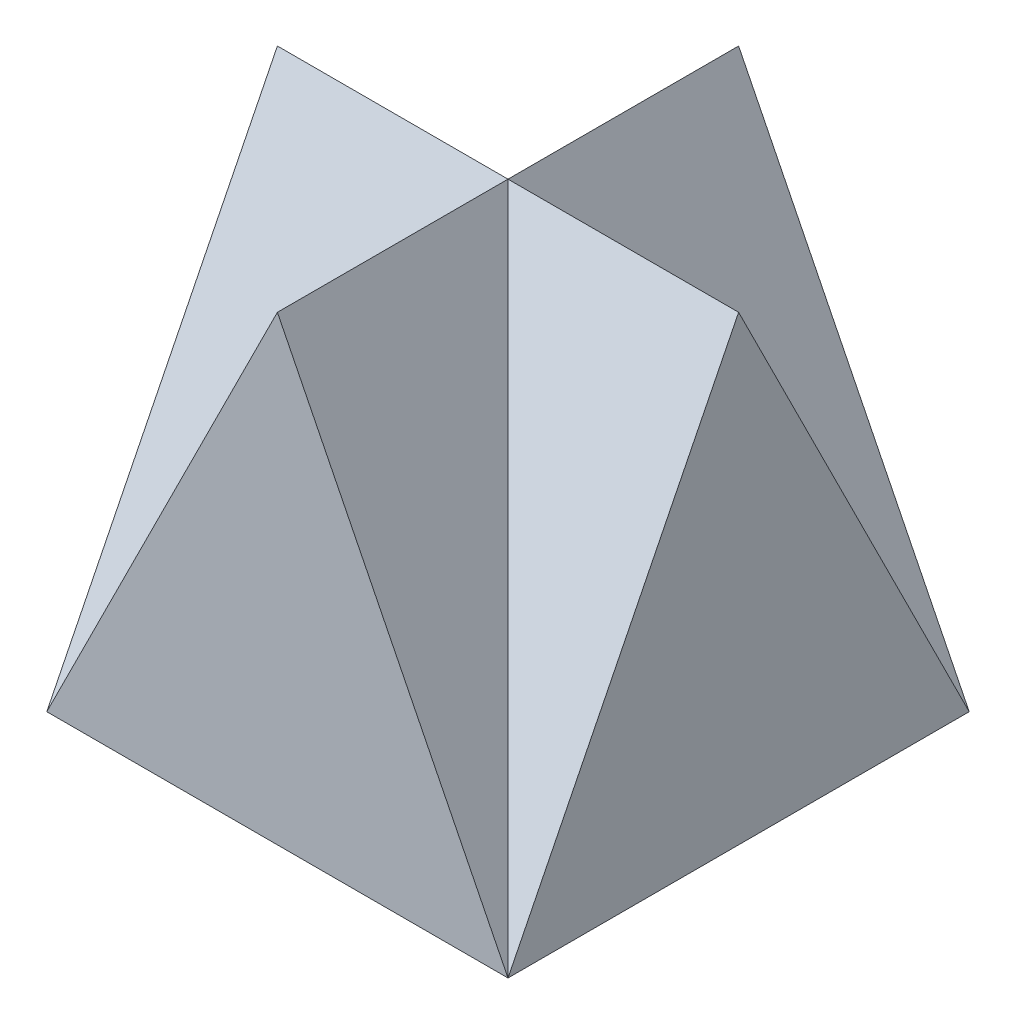
ISO-10303-21;
HEADER;
FILE_DESCRIPTION(('STEP AP214'),'2;1');
FILE_NAME('part.step','',(''),(''),'','','');
FILE_SCHEMA(('AUTOMOTIVE_DESIGN { 1 0 10303 214 1 1 1 1 }'));
ENDSEC;
DATA;
#1=APPLICATION_CONTEXT('core data for automotive mechanical design processes');
#2=APPLICATION_PROTOCOL_DEFINITION('international standard','automotive_design',2000,#1);
#3=PRODUCT_CONTEXT('',#1,'mechanical');
#4=PRODUCT('Part','Part','',(#3));
#5=PRODUCT_RELATED_PRODUCT_CATEGORY('part','',(#4));
#6=PRODUCT_DEFINITION_FORMATION('','',#4);
#7=PRODUCT_DEFINITION_CONTEXT('part definition',#1,'design');
#8=PRODUCT_DEFINITION('design','',#6,#7);
#9=PRODUCT_DEFINITION_SHAPE('','',#8);
#10=(LENGTH_UNIT() NAMED_UNIT(*) SI_UNIT(.MILLI.,.METRE.));
#11=(NAMED_UNIT(*) PLANE_ANGLE_UNIT() SI_UNIT($,.RADIAN.));
#12=(NAMED_UNIT(*) SI_UNIT($,.STERADIAN.) SOLID_ANGLE_UNIT());
#13=UNCERTAINTY_MEASURE_WITH_UNIT(LENGTH_MEASURE(1.E-05),#10,'distance_accuracy_value','');
#14=(GEOMETRIC_REPRESENTATION_CONTEXT(3) GLOBAL_UNCERTAINTY_ASSIGNED_CONTEXT((#13)) GLOBAL_UNIT_ASSIGNED_CONTEXT((#10,
#11,#12)) REPRESENTATION_CONTEXT('',''));
#15=CARTESIAN_POINT('',(0.,0.,0.));
#16=DIRECTION('',(0.,0.,1.));
#17=DIRECTION('',(1.,0.,0.));
#18=AXIS2_PLACEMENT_3D('',#15,#16,#17);
#19=CARTESIAN_POINT('',(1.99999999999999,4.,2.));
#20=DIRECTION('',(-1.,0.,0.));
#21=DIRECTION('',(0.,0.,1.));
#22=AXIS2_PLACEMENT_3D('',#19,#20,#21);
#23=PLANE('',#22);
#24=DIRECTION('',(0.,-0.894427190999916,-0.447213595499958));
#25=VECTOR('',#24,1.);
#26=CARTESIAN_POINT('',(1.99999999999999,4.8,0.399999999999996));
#27=LINE('',#26,#25);
#28=CARTESIAN_POINT('',(1.99999999999999,4.,0.));
#29=VERTEX_POINT('',#28);
#30=CARTESIAN_POINT('',(1.99999999999999,0.,-2.00000000000001));
#31=VERTEX_POINT('',#30);
#32=EDGE_CURVE('E85',#29,#31,#27,.T.);
#33=ORIENTED_EDGE('',*,*,#32,.F.);
#34=DIRECTION('',(0.,-0.894427190999916,0.447213595499958));
#35=VECTOR('',#34,1.);
#36=CARTESIAN_POINT('',(1.99999999999999,3.2,0.399999999999997));
#37=LINE('',#36,#35);
#38=CARTESIAN_POINT('',(1.99999999999999,0.,2.));
#39=VERTEX_POINT('',#38);
#40=EDGE_CURVE('E122',#29,#39,#37,.T.);
#41=ORIENTED_EDGE('',*,*,#40,.T.);
#42=DIRECTION('',(0.,0.,-1.));
#43=VECTOR('',#42,1.);
#44=CARTESIAN_POINT('',(1.99999999999999,0.,2.));
#45=LINE('',#44,#43);
#46=EDGE_CURVE('E119',#39,#31,#45,.T.);
#47=ORIENTED_EDGE('',*,*,#46,.T.);
#48=EDGE_LOOP('',(#33,#41,#47));
#49=FACE_BOUND('',#48,.T.);
#50=ADVANCED_FACE('F38',(#49),#23,.F.);
#51=CARTESIAN_POINT('',(-2.00000000000001,4.,-2.00000000000001));
#52=DIRECTION('',(0.,0.,1.));
#53=DIRECTION('',(1.,0.,0.));
#54=AXIS2_PLACEMENT_3D('',#51,#52,#53);
#55=PLANE('',#54);
#56=DIRECTION('',(0.447213595499958,0.894427190999916,0.));
#57=VECTOR('',#56,1.);
#58=CARTESIAN_POINT('',(-2.00000000000001,0.,-2.00000000000001));
#59=LINE('',#58,#57);
#60=CARTESIAN_POINT('',(-2.00000000000001,0.,-2.00000000000001));
#61=VERTEX_POINT('',#60);
#62=CARTESIAN_POINT('',(0.,4.,-2.00000000000001));
#63=VERTEX_POINT('',#62);
#64=EDGE_CURVE('E113',#61,#63,#59,.T.);
#65=ORIENTED_EDGE('',*,*,#64,.T.);
#66=DIRECTION('',(0.447213595499958,-0.894427190999916,0.));
#67=VECTOR('',#66,1.);
#68=CARTESIAN_POINT('',(0.,4.,-2.00000000000001));
#69=LINE('',#68,#67);
#70=EDGE_CURVE('E97',#63,#31,#69,.T.);
#71=ORIENTED_EDGE('',*,*,#70,.T.);
#72=DIRECTION('',(-1.,0.,0.));
#73=VECTOR('',#72,1.);
#74=CARTESIAN_POINT('',(-2.00000000000001,0.,-2.00000000000001));
#75=LINE('',#74,#73);
#76=EDGE_CURVE('E111',#31,#61,#75,.T.);
#77=ORIENTED_EDGE('',*,*,#76,.T.);
#78=EDGE_LOOP('',(#65,#71,#77));
#79=FACE_BOUND('',#78,.T.);
#80=ADVANCED_FACE('F110',(#79),#55,.F.);
#81=CARTESIAN_POINT('',(-2.00000000000001,4.,2.));
#82=DIRECTION('',(1.,0.,0.));
#83=DIRECTION('',(0.,0.,-1.));
#84=AXIS2_PLACEMENT_3D('',#81,#82,#83);
#85=PLANE('',#84);
#86=DIRECTION('',(0.,-0.894427190999916,0.447213595499959));
#87=VECTOR('',#86,1.);
#88=CARTESIAN_POINT('',(-2.00000000000001,3.2,0.399999999999997));
#89=LINE('',#88,#87);
#90=CARTESIAN_POINT('',(-2.00000000000001,4.,0.));
#91=VERTEX_POINT('',#90);
#92=CARTESIAN_POINT('',(-2.00000000000001,0.,2.));
#93=VERTEX_POINT('',#92);
#94=EDGE_CURVE('E61',#91,#93,#89,.T.);
#95=ORIENTED_EDGE('',*,*,#94,.F.);
#96=DIRECTION('',(0.,-0.894427190999916,-0.447213595499958));
#97=VECTOR('',#96,1.);
#98=CARTESIAN_POINT('',(-2.00000000000001,4.,0.));
#99=LINE('',#98,#97);
#100=EDGE_CURVE('E54',#91,#61,#99,.T.);
#101=ORIENTED_EDGE('',*,*,#100,.T.);
#102=DIRECTION('',(0.,0.,1.));
#103=VECTOR('',#102,1.);
#104=CARTESIAN_POINT('',(-2.00000000000001,0.,2.));
#105=LINE('',#104,#103);
#106=EDGE_CURVE('E46',#61,#93,#105,.T.);
#107=ORIENTED_EDGE('',*,*,#106,.T.);
#108=EDGE_LOOP('',(#95,#101,#107));
#109=FACE_BOUND('',#108,.T.);
#110=ADVANCED_FACE('F195',(#109),#85,.F.);
#111=CARTESIAN_POINT('',(-2.00000000000001,4.,2.));
#112=DIRECTION('',(0.,0.,-1.));
#113=DIRECTION('',(-1.,0.,0.));
#114=AXIS2_PLACEMENT_3D('',#111,#112,#113);
#115=PLANE('',#114);
#116=DIRECTION('',(1.,0.,0.));
#117=VECTOR('',#116,1.);
#118=CARTESIAN_POINT('',(-2.00000000000001,0.,2.));
#119=LINE('',#118,#117);
#120=EDGE_CURVE('E12',#93,#39,#119,.T.);
#121=ORIENTED_EDGE('',*,*,#120,.T.);
#122=DIRECTION('',(0.447213595499958,-0.894427190999916,0.));
#123=VECTOR('',#122,1.);
#124=CARTESIAN_POINT('',(0.,4.,2.));
#125=LINE('',#124,#123);
#126=CARTESIAN_POINT('',(0.,4.,2.));
#127=VERTEX_POINT('',#126);
#128=EDGE_CURVE('E96',#127,#39,#125,.T.);
#129=ORIENTED_EDGE('',*,*,#128,.F.);
#130=DIRECTION('',(-0.447213595499958,-0.894427190999916,0.));
#131=VECTOR('',#130,1.);
#132=CARTESIAN_POINT('',(0.,4.,2.));
#133=LINE('',#132,#131);
#134=EDGE_CURVE('E123',#127,#93,#133,.T.);
#135=ORIENTED_EDGE('',*,*,#134,.T.);
#136=EDGE_LOOP('',(#121,#129,#135));
#137=FACE_BOUND('',#136,.T.);
#138=ADVANCED_FACE('F190',(#137),#115,.F.);
#139=CARTESIAN_POINT('',(0.,0.,0.));
#140=DIRECTION('',(0.,-1.,0.));
#141=DIRECTION('',(0.,0.,-1.));
#142=AXIS2_PLACEMENT_3D('',#139,#140,#141);
#143=PLANE('',#142);
#144=ORIENTED_EDGE('',*,*,#46,.F.);
#145=ORIENTED_EDGE('',*,*,#120,.F.);
#146=ORIENTED_EDGE('',*,*,#106,.F.);
#147=ORIENTED_EDGE('',*,*,#76,.F.);
#148=EDGE_LOOP('',(#144,#145,#146,#147));
#149=FACE_BOUND('',#148,.T.);
#150=ADVANCED_FACE('F117',(#149),#143,.T.);
#151=CARTESIAN_POINT('',(-2.00000000000001,0.,2.));
#152=DIRECTION('',(0.,0.447213595499959,0.894427190999916));
#153=DIRECTION('',(0.,-0.894427190999916,0.447213595499959));
#154=AXIS2_PLACEMENT_3D('',#151,#152,#153);
#155=PLANE('',#154);
#156=ORIENTED_EDGE('',*,*,#94,.T.);
#157=DIRECTION('',(0.408248290463863,0.816496580927726,-0.408248290463864));
#158=VECTOR('',#157,1.);
#159=CARTESIAN_POINT('',(-2.00000000000001,0.,2.));
#160=LINE('',#159,#158);
#161=CARTESIAN_POINT('',(0.,4.,0.));
#162=VERTEX_POINT('',#161);
#163=EDGE_CURVE('E143',#93,#162,#160,.T.);
#164=ORIENTED_EDGE('',*,*,#163,.T.);
#165=DIRECTION('',(-1.,0.,0.));
#166=VECTOR('',#165,1.);
#167=CARTESIAN_POINT('',(0.,4.,0.));
#168=LINE('',#167,#166);
#169=EDGE_CURVE('E137',#162,#91,#168,.T.);
#170=ORIENTED_EDGE('',*,*,#169,.T.);
#171=EDGE_LOOP('',(#156,#164,#170));
#172=FACE_BOUND('',#171,.T.);
#173=ADVANCED_FACE('F193',(#172),#155,.T.);
#174=CARTESIAN_POINT('',(-1.6,0.799999999999996,0.));
#175=DIRECTION('',(-0.894427190999917,0.447213595499957,0.));
#176=DIRECTION('',(-0.447213595499957,-0.894427190999917,0.));
#177=AXIS2_PLACEMENT_3D('',#174,#175,#176);
#178=PLANE('',#177);
#179=ORIENTED_EDGE('',*,*,#134,.F.);
#180=DIRECTION('',(0.,0.,1.));
#181=VECTOR('',#180,1.);
#182=CARTESIAN_POINT('',(0.,4.,0.));
#183=LINE('',#182,#181);
#184=EDGE_CURVE('E139',#162,#127,#183,.T.);
#185=ORIENTED_EDGE('',*,*,#184,.F.);
#186=ORIENTED_EDGE('',*,*,#163,.F.);
#187=EDGE_LOOP('',(#179,#185,#186));
#188=FACE_BOUND('',#187,.T.);
#189=ADVANCED_FACE('F192',(#188),#178,.T.);
#190=CARTESIAN_POINT('',(0.,0.800000000000002,-1.60000000000001));
#191=DIRECTION('',(0.,-0.447213595499958,0.894427190999916));
#192=DIRECTION('',(0.,-0.894427190999916,-0.447213595499958));
#193=AXIS2_PLACEMENT_3D('',#190,#191,#192);
#194=PLANE('',#193);
#195=ORIENTED_EDGE('',*,*,#100,.F.);
#196=ORIENTED_EDGE('',*,*,#169,.F.);
#197=DIRECTION('',(0.408248290463863,0.816496580927726,0.408248290463863));
#198=VECTOR('',#197,1.);
#199=CARTESIAN_POINT('',(-2.00000000000001,0.,-2.00000000000001));
#200=LINE('',#199,#198);
#201=EDGE_CURVE('E140',#61,#162,#200,.T.);
#202=ORIENTED_EDGE('',*,*,#201,.F.);
#203=EDGE_LOOP('',(#195,#196,#202));
#204=FACE_BOUND('',#203,.T.);
#205=ADVANCED_FACE('F244',(#204),#194,.F.);
#206=CARTESIAN_POINT('',(-1.6,0.8,0.));
#207=DIRECTION('',(-0.894427190999916,0.447213595499957,0.));
#208=DIRECTION('',(-0.447213595499957,-0.894427190999916,0.));
#209=AXIS2_PLACEMENT_3D('',#206,#207,#208);
#210=PLANE('',#209);
#211=ORIENTED_EDGE('',*,*,#64,.F.);
#212=ORIENTED_EDGE('',*,*,#201,.T.);
#213=DIRECTION('',(0.,0.,1.));
#214=VECTOR('',#213,1.);
#215=CARTESIAN_POINT('',(0.,4.,0.));
#216=LINE('',#215,#214);
#217=EDGE_CURVE('E103',#63,#162,#216,.T.);
#218=ORIENTED_EDGE('',*,*,#217,.F.);
#219=EDGE_LOOP('',(#211,#212,#218));
#220=FACE_BOUND('',#219,.T.);
#221=ADVANCED_FACE('F252',(#220),#210,.T.);
#222=CARTESIAN_POINT('',(1.99999999999999,0.,2.));
#223=DIRECTION('',(0.,-0.447213595499958,-0.894427190999916));
#224=DIRECTION('',(0.,0.894427190999916,-0.447213595499958));
#225=AXIS2_PLACEMENT_3D('',#222,#223,#224);
#226=PLANE('',#225);
#227=DIRECTION('',(1.,0.,0.));
#228=VECTOR('',#227,1.);
#229=CARTESIAN_POINT('',(0.,4.,0.));
#230=LINE('',#229,#228);
#231=EDGE_CURVE('E91',#162,#29,#230,.T.);
#232=ORIENTED_EDGE('',*,*,#231,.F.);
#233=DIRECTION('',(-0.408248290463863,0.816496580927726,-0.408248290463864));
#234=VECTOR('',#233,1.);
#235=CARTESIAN_POINT('',(1.99999999999999,0.,2.));
#236=LINE('',#235,#234);
#237=EDGE_CURVE('E168',#39,#162,#236,.T.);
#238=ORIENTED_EDGE('',*,*,#237,.F.);
#239=ORIENTED_EDGE('',*,*,#40,.F.);
#240=EDGE_LOOP('',(#232,#238,#239));
#241=FACE_BOUND('',#240,.T.);
#242=ADVANCED_FACE('F260',(#241),#226,.F.);
#243=CARTESIAN_POINT('',(1.6,0.799999999999998,0.));
#244=DIRECTION('',(-0.894427190999916,-0.447213595499958,0.));
#245=DIRECTION('',(0.447213595499958,-0.894427190999916,0.));
#246=AXIS2_PLACEMENT_3D('',#243,#244,#245);
#247=PLANE('',#246);
#248=ORIENTED_EDGE('',*,*,#237,.T.);
#249=ORIENTED_EDGE('',*,*,#184,.T.);
#250=ORIENTED_EDGE('',*,*,#128,.T.);
#251=EDGE_LOOP('',(#248,#249,#250));
#252=FACE_BOUND('',#251,.T.);
#253=ADVANCED_FACE('F186',(#252),#247,.F.);
#254=CARTESIAN_POINT('',(1.99999999999999,0.,-2.00000000000001));
#255=DIRECTION('',(0.,0.447213595499958,-0.894427190999916));
#256=DIRECTION('',(0.,0.894427190999916,0.447213595499958));
#257=AXIS2_PLACEMENT_3D('',#254,#255,#256);
#258=PLANE('',#257);
#259=ORIENTED_EDGE('',*,*,#32,.T.);
#260=DIRECTION('',(-0.408248290463863,0.816496580927726,0.408248290463863));
#261=VECTOR('',#260,1.);
#262=CARTESIAN_POINT('',(1.99999999999999,0.,-2.00000000000001));
#263=LINE('',#262,#261);
#264=EDGE_CURVE('E88',#31,#162,#263,.T.);
#265=ORIENTED_EDGE('',*,*,#264,.T.);
#266=ORIENTED_EDGE('',*,*,#231,.T.);
#267=EDGE_LOOP('',(#259,#265,#266));
#268=FACE_BOUND('',#267,.T.);
#269=ADVANCED_FACE('F87',(#268),#258,.T.);
#270=CARTESIAN_POINT('',(1.6,0.800000000000001,0.));
#271=DIRECTION('',(-0.894427190999916,-0.447213595499959,0.));
#272=DIRECTION('',(0.447213595499959,-0.894427190999915,0.));
#273=AXIS2_PLACEMENT_3D('',#270,#271,#272);
#274=PLANE('',#273);
#275=ORIENTED_EDGE('',*,*,#217,.T.);
#276=ORIENTED_EDGE('',*,*,#264,.F.);
#277=ORIENTED_EDGE('',*,*,#70,.F.);
#278=EDGE_LOOP('',(#275,#276,#277));
#279=FACE_BOUND('',#278,.T.);
#280=ADVANCED_FACE('F101',(#279),#274,.F.);
#281=CLOSED_SHELL('',(#50,#80,#110,#138,#150,#173,#189,#205,#221,#242,#253,#269,#280));
#282=MANIFOLD_SOLID_BREP('B2',#281);
#283=ADVANCED_BREP_SHAPE_REPRESENTATION('',(#18,#282),#14);
#284=SHAPE_DEFINITION_REPRESENTATION(#9,#283);
ENDSEC;
END-ISO-10303-21;
